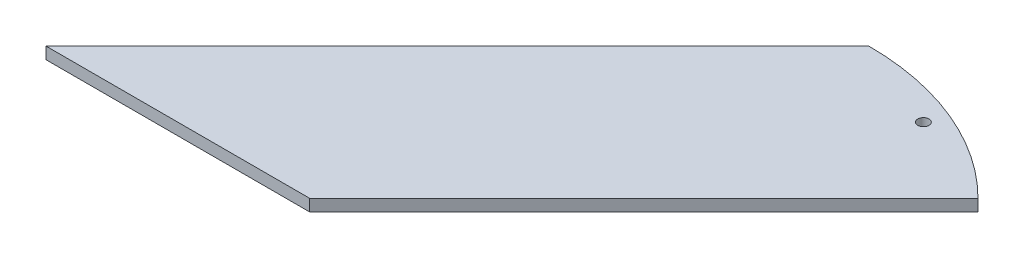
ISO-10303-21;
HEADER;
FILE_DESCRIPTION(('STEP AP214'),'2;1');
FILE_NAME('part.step','',(''),(''),'','','');
FILE_SCHEMA(('AUTOMOTIVE_DESIGN { 1 0 10303 214 1 1 1 1 }'));
ENDSEC;
DATA;
#1=APPLICATION_CONTEXT('core data for automotive mechanical design processes');
#2=APPLICATION_PROTOCOL_DEFINITION('international standard','automotive_design',2000,#1);
#3=PRODUCT_CONTEXT('',#1,'mechanical');
#4=PRODUCT('Part','Part','',(#3));
#5=PRODUCT_RELATED_PRODUCT_CATEGORY('part','',(#4));
#6=PRODUCT_DEFINITION_FORMATION('','',#4);
#7=PRODUCT_DEFINITION_CONTEXT('part definition',#1,'design');
#8=PRODUCT_DEFINITION('design','',#6,#7);
#9=PRODUCT_DEFINITION_SHAPE('','',#8);
#10=(LENGTH_UNIT() NAMED_UNIT(*) SI_UNIT(.MILLI.,.METRE.));
#11=(NAMED_UNIT(*) PLANE_ANGLE_UNIT() SI_UNIT($,.RADIAN.));
#12=(NAMED_UNIT(*) SI_UNIT($,.STERADIAN.) SOLID_ANGLE_UNIT());
#13=UNCERTAINTY_MEASURE_WITH_UNIT(LENGTH_MEASURE(1.E-05),#10,'distance_accuracy_value','');
#14=(GEOMETRIC_REPRESENTATION_CONTEXT(3) GLOBAL_UNCERTAINTY_ASSIGNED_CONTEXT((#13)) GLOBAL_UNIT_ASSIGNED_CONTEXT((#10,
#11,#12)) REPRESENTATION_CONTEXT('',''));
#15=CARTESIAN_POINT('',(0.,0.,0.));
#16=DIRECTION('',(0.,0.,1.));
#17=DIRECTION('',(1.,0.,0.));
#18=AXIS2_PLACEMENT_3D('',#15,#16,#17);
#19=CARTESIAN_POINT('',(-25.,3.175,35.3553390593257));
#20=DIRECTION('',(0.,-1.,0.));
#21=DIRECTION('',(0.,0.,-1.));
#22=AXIS2_PLACEMENT_3D('',#19,#20,#21);
#23=CYLINDRICAL_SURFACE('',#22,70.7106781186535);
#24=CARTESIAN_POINT('',(-25.,0.,35.3553390593257));
#25=DIRECTION('',(0.,1.,0.));
#26=DIRECTION('',(0.,0.,1.));
#27=AXIS2_PLACEMENT_3D('',#24,#25,#26);
#28=CIRCLE('',#27,70.7106781186535);
#29=CARTESIAN_POINT('',(-25.,0.,-35.3553390593277));
#30=VERTEX_POINT('',#29);
#31=CARTESIAN_POINT('',(24.9999999999998,0.,-14.6446609406727));
#32=VERTEX_POINT('',#31);
#33=EDGE_CURVE('E100',#30,#32,#28,.F.);
#34=ORIENTED_EDGE('',*,*,#33,.F.);
#35=DIRECTION('',(0.,-1.,0.));
#36=VECTOR('',#35,1.);
#37=CARTESIAN_POINT('',(-25.,3.175,-35.3553390593277));
#38=LINE('',#37,#36);
#39=CARTESIAN_POINT('',(-25.,3.175,-35.3553390593277));
#40=VERTEX_POINT('',#39);
#41=EDGE_CURVE('E11',#40,#30,#38,.T.);
#42=ORIENTED_EDGE('',*,*,#41,.F.);
#43=CARTESIAN_POINT('',(-25.,3.175,35.3553390593257));
#44=DIRECTION('',(0.,1.,0.));
#45=DIRECTION('',(0.,0.,1.));
#46=AXIS2_PLACEMENT_3D('',#43,#44,#45);
#47=CIRCLE('',#46,70.7106781186535);
#48=CARTESIAN_POINT('',(24.9999999999998,3.175,-14.6446609406727));
#49=VERTEX_POINT('',#48);
#50=EDGE_CURVE('E91',#40,#49,#47,.F.);
#51=ORIENTED_EDGE('',*,*,#50,.T.);
#52=DIRECTION('',(0.,-1.,0.));
#53=VECTOR('',#52,1.);
#54=CARTESIAN_POINT('',(24.9999999999998,3.175,-14.6446609406727));
#55=LINE('',#54,#53);
#56=EDGE_CURVE('E71',#49,#32,#55,.T.);
#57=ORIENTED_EDGE('',*,*,#56,.T.);
#58=EDGE_LOOP('',(#34,#42,#51,#57));
#59=FACE_BOUND('',#58,.T.);
#60=ADVANCED_FACE('F33',(#59),#23,.T.);
#61=CARTESIAN_POINT('',(-30.1776695296637,3.175,-30.1776695296641));
#62=DIRECTION('',(-0.707106781186543,0.,-0.707106781186552));
#63=DIRECTION('',(-0.707106781186552,0.,0.707106781186543));
#64=AXIS2_PLACEMENT_3D('',#61,#62,#63);
#65=PLANE('',#64);
#66=DIRECTION('',(0.707106781186552,0.,-0.707106781186543));
#67=VECTOR('',#66,1.);
#68=CARTESIAN_POINT('',(-30.1776695296637,0.,-30.1776695296641));
#69=LINE('',#68,#67);
#70=CARTESIAN_POINT('',(-135.355339059329,0.,75.0000000000001));
#71=VERTEX_POINT('',#70);
#72=EDGE_CURVE('E84',#71,#30,#69,.T.);
#73=ORIENTED_EDGE('',*,*,#72,.F.);
#74=DIRECTION('',(0.,-1.,0.));
#75=VECTOR('',#74,1.);
#76=CARTESIAN_POINT('',(-135.355339059329,3.175,75.0000000000001));
#77=LINE('',#76,#75);
#78=CARTESIAN_POINT('',(-135.355339059329,3.175,75.0000000000001));
#79=VERTEX_POINT('',#78);
#80=EDGE_CURVE('E41',#79,#71,#77,.T.);
#81=ORIENTED_EDGE('',*,*,#80,.F.);
#82=DIRECTION('',(0.707106781186552,0.,-0.707106781186543));
#83=VECTOR('',#82,1.);
#84=CARTESIAN_POINT('',(-30.1776695296637,3.175,-30.1776695296641));
#85=LINE('',#84,#83);
#86=EDGE_CURVE('E82',#79,#40,#85,.T.);
#87=ORIENTED_EDGE('',*,*,#86,.T.);
#88=ORIENTED_EDGE('',*,*,#41,.T.);
#89=EDGE_LOOP('',(#73,#81,#87,#88));
#90=FACE_BOUND('',#89,.T.);
#91=ADVANCED_FACE('F80',(#90),#65,.T.);
#92=CARTESIAN_POINT('',(0.,3.175,75.0000000000001));
#93=DIRECTION('',(0.,0.,-1.));
#94=DIRECTION('',(-1.,0.,0.));
#95=AXIS2_PLACEMENT_3D('',#92,#93,#94);
#96=PLANE('',#95);
#97=DIRECTION('',(1.,0.,0.));
#98=VECTOR('',#97,1.);
#99=CARTESIAN_POINT('',(0.,0.,75.0000000000001));
#100=LINE('',#99,#98);
#101=CARTESIAN_POINT('',(-64.6446609406742,0.,75.0000000000001));
#102=VERTEX_POINT('',#101);
#103=EDGE_CURVE('E64',#71,#102,#100,.T.);
#104=ORIENTED_EDGE('',*,*,#103,.T.);
#105=DIRECTION('',(0.,-1.,0.));
#106=VECTOR('',#105,1.);
#107=CARTESIAN_POINT('',(-64.6446609406742,3.175,75.0000000000001));
#108=LINE('',#107,#106);
#109=CARTESIAN_POINT('',(-64.6446609406742,3.175,75.0000000000001));
#110=VERTEX_POINT('',#109);
#111=EDGE_CURVE('E85',#110,#102,#108,.T.);
#112=ORIENTED_EDGE('',*,*,#111,.F.);
#113=DIRECTION('',(1.,0.,0.));
#114=VECTOR('',#113,1.);
#115=CARTESIAN_POINT('',(0.,3.175,75.0000000000001));
#116=LINE('',#115,#114);
#117=EDGE_CURVE('E86',#79,#110,#116,.T.);
#118=ORIENTED_EDGE('',*,*,#117,.F.);
#119=ORIENTED_EDGE('',*,*,#80,.T.);
#120=EDGE_LOOP('',(#104,#112,#118,#119));
#121=FACE_BOUND('',#120,.T.);
#122=ADVANCED_FACE('F87',(#121),#96,.F.);
#123=CARTESIAN_POINT('',(5.17766952966341,3.175,5.17766952966348));
#124=DIRECTION('',(-0.707106781186543,0.,-0.707106781186552));
#125=DIRECTION('',(-0.707106781186552,0.,0.707106781186543));
#126=AXIS2_PLACEMENT_3D('',#123,#124,#125);
#127=PLANE('',#126);
#128=DIRECTION('',(0.707106781186552,0.,-0.707106781186543));
#129=VECTOR('',#128,1.);
#130=CARTESIAN_POINT('',(5.17766952966341,0.,5.17766952966348));
#131=LINE('',#130,#129);
#132=EDGE_CURVE('E105',#102,#32,#131,.T.);
#133=ORIENTED_EDGE('',*,*,#132,.T.);
#134=ORIENTED_EDGE('',*,*,#56,.F.);
#135=DIRECTION('',(0.707106781186552,0.,-0.707106781186543));
#136=VECTOR('',#135,1.);
#137=CARTESIAN_POINT('',(5.17766952966341,3.175,5.17766952966348));
#138=LINE('',#137,#136);
#139=EDGE_CURVE('E49',#110,#49,#138,.T.);
#140=ORIENTED_EDGE('',*,*,#139,.F.);
#141=ORIENTED_EDGE('',*,*,#111,.T.);
#142=EDGE_LOOP('',(#133,#134,#140,#141));
#143=FACE_BOUND('',#142,.T.);
#144=ADVANCED_FACE('F112',(#143),#127,.F.);
#145=CARTESIAN_POINT('',(0.,3.175,-25.0000000000005));
#146=DIRECTION('',(0.,-1.,0.));
#147=DIRECTION('',(0.,0.,-1.));
#148=AXIS2_PLACEMENT_3D('',#145,#146,#147);
#149=CYLINDRICAL_SURFACE('',#148,1.49999999999986);
#150=CARTESIAN_POINT('',(0.,3.175,-25.0000000000005));
#151=DIRECTION('',(0.,1.,0.));
#152=DIRECTION('',(0.,0.,1.));
#153=AXIS2_PLACEMENT_3D('',#150,#151,#152);
#154=CIRCLE('',#153,1.49999999999986);
#155=CARTESIAN_POINT('',(0.,3.175,-23.5000000000006));
#156=VERTEX_POINT('',#155);
#157=EDGE_CURVE('E97',#156,#156,#154,.T.);
#158=ORIENTED_EDGE('',*,*,#157,.T.);
#159=EDGE_LOOP('',(#158));
#160=FACE_BOUND('',#159,.T.);
#161=CARTESIAN_POINT('',(0.,0.,-25.0000000000005));
#162=DIRECTION('',(0.,1.,0.));
#163=DIRECTION('',(0.,0.,1.));
#164=AXIS2_PLACEMENT_3D('',#161,#162,#163);
#165=CIRCLE('',#164,1.49999999999986);
#166=CARTESIAN_POINT('',(0.,0.,-23.5000000000006));
#167=VERTEX_POINT('',#166);
#168=EDGE_CURVE('E93',#167,#167,#165,.T.);
#169=ORIENTED_EDGE('',*,*,#168,.F.);
#170=EDGE_LOOP('',(#169));
#171=FACE_BOUND('',#170,.T.);
#172=ADVANCED_FACE('F127',(#160,#171),#149,.F.);
#173=CARTESIAN_POINT('',(0.,3.175,0.));
#174=DIRECTION('',(0.,1.,0.));
#175=DIRECTION('',(0.,0.,1.));
#176=AXIS2_PLACEMENT_3D('',#173,#174,#175);
#177=PLANE('',#176);
#178=ORIENTED_EDGE('',*,*,#50,.F.);
#179=ORIENTED_EDGE('',*,*,#86,.F.);
#180=ORIENTED_EDGE('',*,*,#117,.T.);
#181=ORIENTED_EDGE('',*,*,#139,.T.);
#182=EDGE_LOOP('',(#178,#179,#180,#181));
#183=FACE_BOUND('',#182,.T.);
#184=ORIENTED_EDGE('',*,*,#157,.F.);
#185=EDGE_LOOP('',(#184));
#186=FACE_BOUND('',#185,.T.);
#187=ADVANCED_FACE('F89',(#183,#186),#177,.T.);
#188=CARTESIAN_POINT('',(0.,0.,0.));
#189=DIRECTION('',(0.,1.,0.));
#190=DIRECTION('',(0.,0.,1.));
#191=AXIS2_PLACEMENT_3D('',#188,#189,#190);
#192=PLANE('',#191);
#193=ORIENTED_EDGE('',*,*,#33,.T.);
#194=ORIENTED_EDGE('',*,*,#132,.F.);
#195=ORIENTED_EDGE('',*,*,#103,.F.);
#196=ORIENTED_EDGE('',*,*,#72,.T.);
#197=EDGE_LOOP('',(#193,#194,#195,#196));
#198=FACE_BOUND('',#197,.T.);
#199=ORIENTED_EDGE('',*,*,#168,.T.);
#200=EDGE_LOOP('',(#199));
#201=FACE_BOUND('',#200,.T.);
#202=ADVANCED_FACE('F114',(#198,#201),#192,.F.);
#203=CLOSED_SHELL('',(#60,#91,#122,#144,#172,#187,#202));
#204=MANIFOLD_SOLID_BREP('B2',#203);
#205=ADVANCED_BREP_SHAPE_REPRESENTATION('',(#18,#204),#14);
#206=SHAPE_DEFINITION_REPRESENTATION(#9,#205);
ENDSEC;
END-ISO-10303-21;
